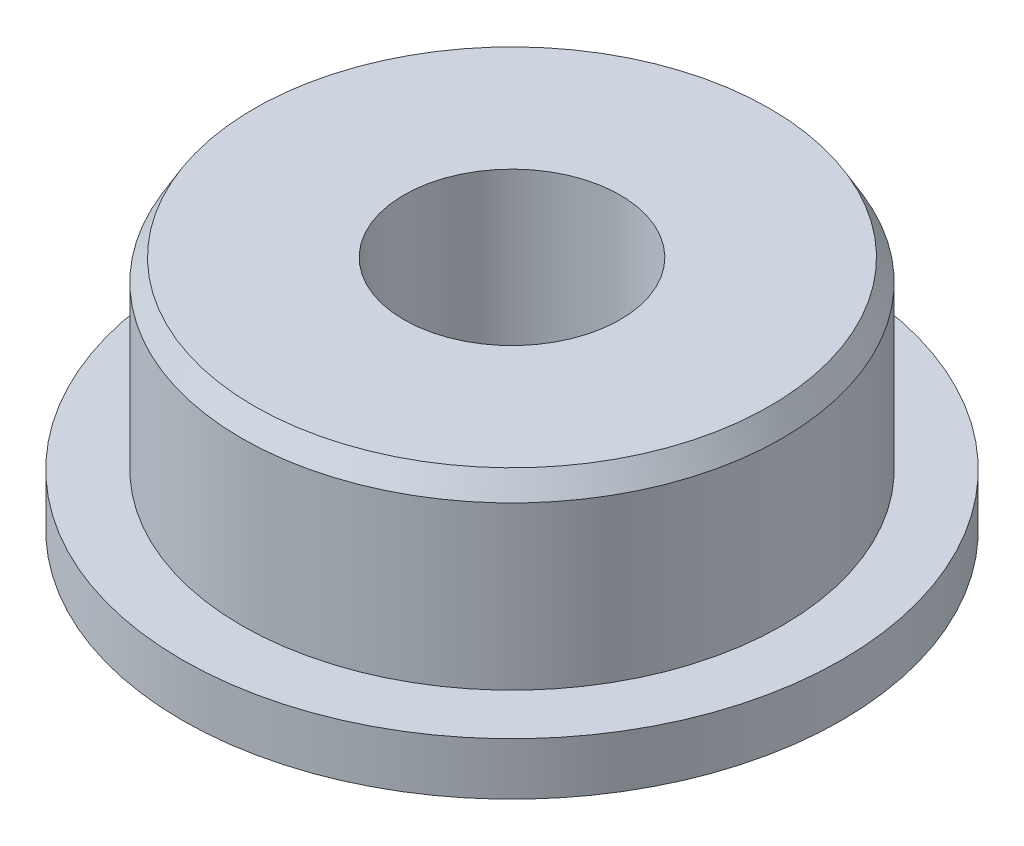
ISO-10303-21;
HEADER;
FILE_DESCRIPTION(('STEP AP214'),'2;1');
FILE_NAME('part.step','',(''),(''),'','','');
FILE_SCHEMA(('AUTOMOTIVE_DESIGN { 1 0 10303 214 1 1 1 1 }'));
ENDSEC;
DATA;
#1=APPLICATION_CONTEXT('core data for automotive mechanical design processes');
#2=APPLICATION_PROTOCOL_DEFINITION('international standard','automotive_design',2000,#1);
#3=PRODUCT_CONTEXT('',#1,'mechanical');
#4=PRODUCT('Part','Part','',(#3));
#5=PRODUCT_RELATED_PRODUCT_CATEGORY('part','',(#4));
#6=PRODUCT_DEFINITION_FORMATION('','',#4);
#7=PRODUCT_DEFINITION_CONTEXT('part definition',#1,'design');
#8=PRODUCT_DEFINITION('design','',#6,#7);
#9=PRODUCT_DEFINITION_SHAPE('','',#8);
#10=(LENGTH_UNIT() NAMED_UNIT(*) SI_UNIT(.MILLI.,.METRE.));
#11=(NAMED_UNIT(*) PLANE_ANGLE_UNIT() SI_UNIT($,.RADIAN.));
#12=(NAMED_UNIT(*) SI_UNIT($,.STERADIAN.) SOLID_ANGLE_UNIT());
#13=UNCERTAINTY_MEASURE_WITH_UNIT(LENGTH_MEASURE(1.E-05),#10,'distance_accuracy_value','');
#14=(GEOMETRIC_REPRESENTATION_CONTEXT(3) GLOBAL_UNCERTAINTY_ASSIGNED_CONTEXT((#13)) GLOBAL_UNIT_ASSIGNED_CONTEXT((#10,
#11,#12)) REPRESENTATION_CONTEXT('',''));
#15=CARTESIAN_POINT('',(0.,0.,0.));
#16=DIRECTION('',(0.,0.,1.));
#17=DIRECTION('',(1.,0.,0.));
#18=AXIS2_PLACEMENT_3D('',#15,#16,#17);
#19=CARTESIAN_POINT('',(0.,2.3,0.));
#20=DIRECTION('',(0.,-1.,0.));
#21=DIRECTION('',(0.,0.,-1.));
#22=AXIS2_PLACEMENT_3D('',#19,#20,#21);
#23=CYLINDRICAL_SURFACE('',#22,0.999999999999999);
#24=CARTESIAN_POINT('',(0.,2.3,0.));
#25=DIRECTION('',(0.,1.,0.));
#26=DIRECTION('',(0.,0.,1.));
#27=AXIS2_PLACEMENT_3D('',#24,#25,#26);
#28=CIRCLE('',#27,0.999999999999999);
#29=CARTESIAN_POINT('',(0.,2.3,0.999999999999999));
#30=VERTEX_POINT('',#29);
#31=EDGE_CURVE('E54',#30,#30,#28,.T.);
#32=ORIENTED_EDGE('',*,*,#31,.T.);
#33=EDGE_LOOP('',(#32));
#34=FACE_BOUND('',#33,.T.);
#35=CARTESIAN_POINT('',(0.,0.,0.));
#36=DIRECTION('',(0.,1.,0.));
#37=DIRECTION('',(0.,0.,1.));
#38=AXIS2_PLACEMENT_3D('',#35,#36,#37);
#39=CIRCLE('',#38,0.999999999999999);
#40=CARTESIAN_POINT('',(0.,0.,0.999999999999999));
#41=VERTEX_POINT('',#40);
#42=EDGE_CURVE('E55',#41,#41,#39,.T.);
#43=ORIENTED_EDGE('',*,*,#42,.F.);
#44=EDGE_LOOP('',(#43));
#45=FACE_BOUND('',#44,.T.);
#46=ADVANCED_FACE('F34',(#34,#45),#23,.F.);
#47=CARTESIAN_POINT('',(0.,2.3,0.));
#48=DIRECTION('',(0.,-1.,0.));
#49=DIRECTION('',(0.,0.,-1.));
#50=AXIS2_PLACEMENT_3D('',#47,#48,#49);
#51=CYLINDRICAL_SURFACE('',#50,2.5);
#52=CARTESIAN_POINT('',(0.,2.1,0.));
#53=DIRECTION('',(0.,1.,0.));
#54=DIRECTION('',(0.,0.,1.));
#55=AXIS2_PLACEMENT_3D('',#52,#53,#54);
#56=CIRCLE('',#55,2.5);
#57=CARTESIAN_POINT('',(0.,2.1,2.5));
#58=VERTEX_POINT('',#57);
#59=EDGE_CURVE('E10',#58,#58,#56,.F.);
#60=ORIENTED_EDGE('',*,*,#59,.T.);
#61=EDGE_LOOP('',(#60));
#62=FACE_BOUND('',#61,.T.);
#63=CARTESIAN_POINT('',(0.,0.6,0.));
#64=DIRECTION('',(0.,1.,0.));
#65=DIRECTION('',(0.,0.,1.));
#66=AXIS2_PLACEMENT_3D('',#63,#64,#65);
#67=CIRCLE('',#66,2.5);
#68=CARTESIAN_POINT('',(0.,0.6,2.5));
#69=VERTEX_POINT('',#68);
#70=EDGE_CURVE('E63',#69,#69,#67,.T.);
#71=ORIENTED_EDGE('',*,*,#70,.T.);
#72=EDGE_LOOP('',(#71));
#73=FACE_BOUND('',#72,.T.);
#74=ADVANCED_FACE('F67',(#62,#73),#51,.T.);
#75=CARTESIAN_POINT('',(0.,2.3,0.));
#76=DIRECTION('',(0.,1.,0.));
#77=DIRECTION('',(0.,0.,1.));
#78=AXIS2_PLACEMENT_3D('',#75,#76,#77);
#79=PLANE('',#78);
#80=CARTESIAN_POINT('',(0.,2.3,0.));
#81=DIRECTION('',(0.,1.,0.));
#82=DIRECTION('',(0.,0.,1.));
#83=AXIS2_PLACEMENT_3D('',#80,#81,#82);
#84=CIRCLE('',#83,2.38452994616207);
#85=CARTESIAN_POINT('',(0.,2.3,2.38452994616207));
#86=VERTEX_POINT('',#85);
#87=EDGE_CURVE('E41',#86,#86,#84,.T.);
#88=ORIENTED_EDGE('',*,*,#87,.T.);
#89=EDGE_LOOP('',(#88));
#90=FACE_BOUND('',#89,.T.);
#91=ORIENTED_EDGE('',*,*,#31,.F.);
#92=EDGE_LOOP('',(#91));
#93=FACE_BOUND('',#92,.T.);
#94=ADVANCED_FACE('F84',(#90,#93),#79,.T.);
#95=CARTESIAN_POINT('',(0.,0.,0.));
#96=DIRECTION('',(0.,1.,0.));
#97=DIRECTION('',(0.,0.,1.));
#98=AXIS2_PLACEMENT_3D('',#95,#96,#97);
#99=PLANE('',#98);
#100=CARTESIAN_POINT('',(0.,0.,0.));
#101=DIRECTION('',(0.,1.,0.));
#102=DIRECTION('',(0.,0.,1.));
#103=AXIS2_PLACEMENT_3D('',#100,#101,#102);
#104=CIRCLE('',#103,2.85);
#105=CARTESIAN_POINT('',(0.,0.,2.85));
#106=VERTEX_POINT('',#105);
#107=EDGE_CURVE('E45',#106,#106,#104,.F.);
#108=ORIENTED_EDGE('',*,*,#107,.T.);
#109=EDGE_LOOP('',(#108));
#110=FACE_BOUND('',#109,.T.);
#111=ORIENTED_EDGE('',*,*,#42,.T.);
#112=EDGE_LOOP('',(#111));
#113=FACE_BOUND('',#112,.T.);
#114=ADVANCED_FACE('F78',(#110,#113),#99,.F.);
#115=CARTESIAN_POINT('',(0.,0.6,0.));
#116=DIRECTION('',(0.,-1.,0.));
#117=DIRECTION('',(0.,0.,-1.));
#118=AXIS2_PLACEMENT_3D('',#115,#116,#117);
#119=CYLINDRICAL_SURFACE('',#118,3.05);
#120=CARTESIAN_POINT('',(0.,0.115470053837926,0.));
#121=DIRECTION('',(0.,1.,0.));
#122=DIRECTION('',(0.,0.,1.));
#123=AXIS2_PLACEMENT_3D('',#120,#121,#122);
#124=CIRCLE('',#123,3.05);
#125=CARTESIAN_POINT('',(0.,0.115470053837926,3.05));
#126=VERTEX_POINT('',#125);
#127=EDGE_CURVE('E49',#126,#126,#124,.T.);
#128=ORIENTED_EDGE('',*,*,#127,.T.);
#129=EDGE_LOOP('',(#128));
#130=FACE_BOUND('',#129,.T.);
#131=CARTESIAN_POINT('',(0.,0.6,0.));
#132=DIRECTION('',(0.,1.,0.));
#133=DIRECTION('',(0.,0.,1.));
#134=AXIS2_PLACEMENT_3D('',#131,#132,#133);
#135=CIRCLE('',#134,3.05);
#136=CARTESIAN_POINT('',(0.,0.6,3.05));
#137=VERTEX_POINT('',#136);
#138=EDGE_CURVE('E58',#137,#137,#135,.T.);
#139=ORIENTED_EDGE('',*,*,#138,.F.);
#140=EDGE_LOOP('',(#139));
#141=FACE_BOUND('',#140,.T.);
#142=ADVANCED_FACE('F73',(#130,#141),#119,.T.);
#143=CARTESIAN_POINT('',(0.,0.6,0.));
#144=DIRECTION('',(0.,1.,0.));
#145=DIRECTION('',(0.,0.,1.));
#146=AXIS2_PLACEMENT_3D('',#143,#144,#145);
#147=PLANE('',#146);
#148=ORIENTED_EDGE('',*,*,#70,.F.);
#149=EDGE_LOOP('',(#148));
#150=FACE_BOUND('',#149,.T.);
#151=ORIENTED_EDGE('',*,*,#138,.T.);
#152=EDGE_LOOP('',(#151));
#153=FACE_BOUND('',#152,.T.);
#154=ADVANCED_FACE('F69',(#150,#153),#147,.T.);
#155=CARTESIAN_POINT('',(0.,0.115470053837926,0.));
#156=DIRECTION('',(0.,1.,0.));
#157=DIRECTION('',(0.,0.,1.));
#158=AXIS2_PLACEMENT_3D('',#155,#156,#157);
#159=CONICAL_SURFACE('',#158,3.05,1.0471975511966);
#160=ORIENTED_EDGE('',*,*,#107,.F.);
#161=EDGE_LOOP('',(#160));
#162=FACE_BOUND('',#161,.T.);
#163=ORIENTED_EDGE('',*,*,#127,.F.);
#164=EDGE_LOOP('',(#163));
#165=FACE_BOUND('',#164,.T.);
#166=ADVANCED_FACE('F72',(#162,#165),#159,.T.);
#167=CARTESIAN_POINT('',(0.,2.3,0.));
#168=DIRECTION('',(0.,-1.,0.));
#169=DIRECTION('',(0.,0.,-1.));
#170=AXIS2_PLACEMENT_3D('',#167,#168,#169);
#171=CONICAL_SURFACE('',#170,2.38452994616207,0.523598775598299);
#172=ORIENTED_EDGE('',*,*,#59,.F.);
#173=EDGE_LOOP('',(#172));
#174=FACE_BOUND('',#173,.T.);
#175=ORIENTED_EDGE('',*,*,#87,.F.);
#176=EDGE_LOOP('',(#175));
#177=FACE_BOUND('',#176,.T.);
#178=ADVANCED_FACE('F36',(#174,#177),#171,.T.);
#179=CLOSED_SHELL('',(#46,#74,#94,#114,#142,#154,#166,#178));
#180=MANIFOLD_SOLID_BREP('B2',#179);
#181=ADVANCED_BREP_SHAPE_REPRESENTATION('',(#18,#180),#14);
#182=SHAPE_DEFINITION_REPRESENTATION(#9,#181);
ENDSEC;
END-ISO-10303-21;
